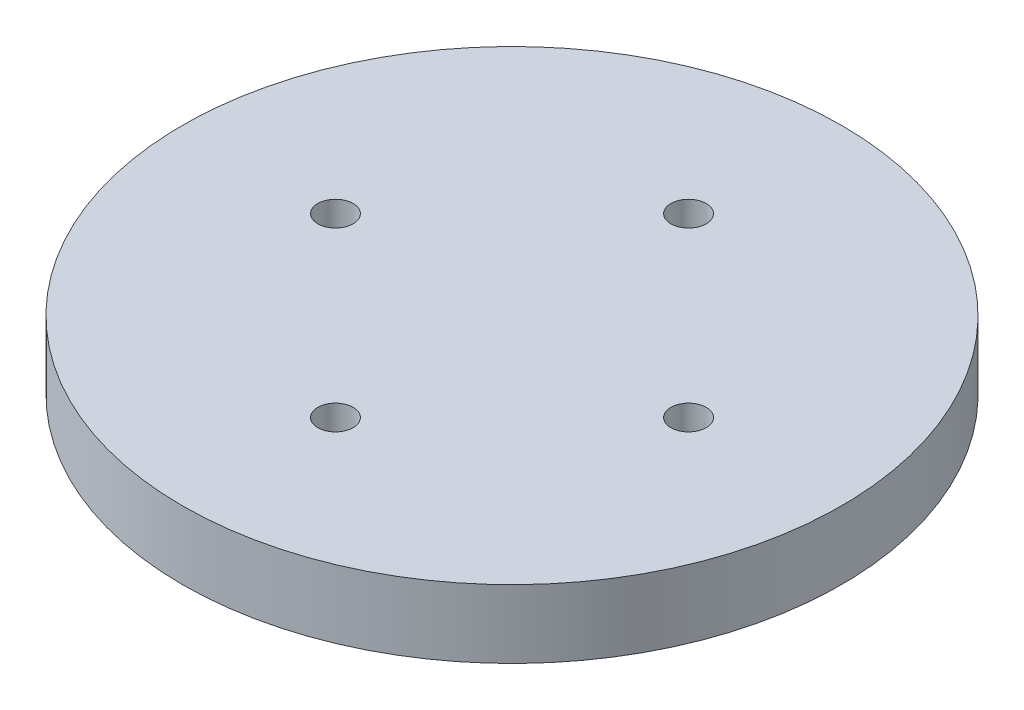
ISO-10303-21;
HEADER;
FILE_DESCRIPTION(('STEP AP214'),'2;1');
FILE_NAME('part.step','',(''),(''),'','','');
FILE_SCHEMA(('AUTOMOTIVE_DESIGN { 1 0 10303 214 1 1 1 1 }'));
ENDSEC;
DATA;
#1=APPLICATION_CONTEXT('core data for automotive mechanical design processes');
#2=APPLICATION_PROTOCOL_DEFINITION('international standard','automotive_design',2000,#1);
#3=PRODUCT_CONTEXT('',#1,'mechanical');
#4=PRODUCT('Part','Part','',(#3));
#5=PRODUCT_RELATED_PRODUCT_CATEGORY('part','',(#4));
#6=PRODUCT_DEFINITION_FORMATION('','',#4);
#7=PRODUCT_DEFINITION_CONTEXT('part definition',#1,'design');
#8=PRODUCT_DEFINITION('design','',#6,#7);
#9=PRODUCT_DEFINITION_SHAPE('','',#8);
#10=(LENGTH_UNIT() NAMED_UNIT(*) SI_UNIT(.MILLI.,.METRE.));
#11=(NAMED_UNIT(*) PLANE_ANGLE_UNIT() SI_UNIT($,.RADIAN.));
#12=(NAMED_UNIT(*) SI_UNIT($,.STERADIAN.) SOLID_ANGLE_UNIT());
#13=UNCERTAINTY_MEASURE_WITH_UNIT(LENGTH_MEASURE(1.E-05),#10,'distance_accuracy_value','');
#14=(GEOMETRIC_REPRESENTATION_CONTEXT(3) GLOBAL_UNCERTAINTY_ASSIGNED_CONTEXT((#13)) GLOBAL_UNIT_ASSIGNED_CONTEXT((#10,
#11,#12)) REPRESENTATION_CONTEXT('',''));
#15=CARTESIAN_POINT('',(0.,0.,0.));
#16=DIRECTION('',(0.,0.,1.));
#17=DIRECTION('',(1.,0.,0.));
#18=AXIS2_PLACEMENT_3D('',#15,#16,#17);
#19=CARTESIAN_POINT('',(0.,5.8,0.));
#20=DIRECTION('',(0.,1.,0.));
#21=DIRECTION('',(0.,0.,1.));
#22=AXIS2_PLACEMENT_3D('',#19,#20,#21);
#23=PLANE('',#22);
#24=CARTESIAN_POINT('',(8.48977342514678E-13,5.8,15.));
#25=DIRECTION('',(0.,1.,0.));
#26=DIRECTION('',(0.,0.,1.));
#27=AXIS2_PLACEMENT_3D('',#24,#25,#26);
#28=CIRCLE('',#27,1.50000000000091);
#29=CARTESIAN_POINT('',(8.48977342514678E-13,5.8,16.5000000000009));
#30=VERTEX_POINT('',#29);
#31=EDGE_CURVE('E54',#30,#30,#28,.T.);
#32=ORIENTED_EDGE('',*,*,#31,.F.);
#33=EDGE_LOOP('',(#32));
#34=FACE_BOUND('',#33,.T.);
#35=CARTESIAN_POINT('',(0.,5.8,-15.));
#36=DIRECTION('',(0.,1.,0.));
#37=DIRECTION('',(0.,0.,1.));
#38=AXIS2_PLACEMENT_3D('',#35,#36,#37);
#39=CIRCLE('',#38,1.5);
#40=CARTESIAN_POINT('',(0.,5.8,-13.5));
#41=VERTEX_POINT('',#40);
#42=EDGE_CURVE('E43',#41,#41,#39,.T.);
#43=ORIENTED_EDGE('',*,*,#42,.F.);
#44=EDGE_LOOP('',(#43));
#45=FACE_BOUND('',#44,.T.);
#46=CARTESIAN_POINT('',(0.,5.8,0.));
#47=DIRECTION('',(0.,1.,0.));
#48=DIRECTION('',(0.,0.,1.));
#49=AXIS2_PLACEMENT_3D('',#46,#47,#48);
#50=CIRCLE('',#49,28.);
#51=CARTESIAN_POINT('',(0.,5.8,28.));
#52=VERTEX_POINT('',#51);
#53=EDGE_CURVE('E10',#52,#52,#50,.T.);
#54=ORIENTED_EDGE('',*,*,#53,.T.);
#55=EDGE_LOOP('',(#54));
#56=FACE_BOUND('',#55,.T.);
#57=CARTESIAN_POINT('',(15.0000000000004,5.8,-4.24488671257339E-13));
#58=DIRECTION('',(0.,1.,0.));
#59=DIRECTION('',(0.,0.,1.));
#60=AXIS2_PLACEMENT_3D('',#57,#58,#59);
#61=CIRCLE('',#60,1.50000000000033);
#62=CARTESIAN_POINT('',(15.0000000000004,5.8,1.49999999999991));
#63=VERTEX_POINT('',#62);
#64=EDGE_CURVE('E48',#63,#63,#61,.T.);
#65=ORIENTED_EDGE('',*,*,#64,.F.);
#66=EDGE_LOOP('',(#65));
#67=FACE_BOUND('',#66,.T.);
#68=CARTESIAN_POINT('',(-14.9999999999996,5.8,4.2632564145606E-13));
#69=DIRECTION('',(0.,1.,0.));
#70=DIRECTION('',(0.,0.,1.));
#71=AXIS2_PLACEMENT_3D('',#68,#69,#70);
#72=CIRCLE('',#71,1.50000000000068);
#73=CARTESIAN_POINT('',(-14.9999999999996,5.8,1.50000000000111));
#74=VERTEX_POINT('',#73);
#75=EDGE_CURVE('E60',#74,#74,#72,.T.);
#76=ORIENTED_EDGE('',*,*,#75,.F.);
#77=EDGE_LOOP('',(#76));
#78=FACE_BOUND('',#77,.T.);
#79=ADVANCED_FACE('F32',(#34,#45,#56,#67,#78),#23,.T.);
#80=CARTESIAN_POINT('',(0.,0.,0.));
#81=DIRECTION('',(0.,1.,0.));
#82=DIRECTION('',(0.,0.,1.));
#83=AXIS2_PLACEMENT_3D('',#80,#81,#82);
#84=PLANE('',#83);
#85=CARTESIAN_POINT('',(0.,0.,0.));
#86=DIRECTION('',(0.,1.,0.));
#87=DIRECTION('',(0.,0.,1.));
#88=AXIS2_PLACEMENT_3D('',#85,#86,#87);
#89=CIRCLE('',#88,28.);
#90=CARTESIAN_POINT('',(0.,0.,28.));
#91=VERTEX_POINT('',#90);
#92=EDGE_CURVE('E36',#91,#91,#89,.T.);
#93=ORIENTED_EDGE('',*,*,#92,.F.);
#94=EDGE_LOOP('',(#93));
#95=FACE_BOUND('',#94,.T.);
#96=CARTESIAN_POINT('',(0.,0.,-15.));
#97=DIRECTION('',(0.,1.,0.));
#98=DIRECTION('',(0.,0.,1.));
#99=AXIS2_PLACEMENT_3D('',#96,#97,#98);
#100=CIRCLE('',#99,1.5);
#101=CARTESIAN_POINT('',(0.,0.,-13.5));
#102=VERTEX_POINT('',#101);
#103=EDGE_CURVE('E45',#102,#102,#100,.T.);
#104=ORIENTED_EDGE('',*,*,#103,.T.);
#105=EDGE_LOOP('',(#104));
#106=FACE_BOUND('',#105,.T.);
#107=CARTESIAN_POINT('',(15.0000000000004,0.,-4.24488671257339E-13));
#108=DIRECTION('',(0.,1.,0.));
#109=DIRECTION('',(0.,0.,1.));
#110=AXIS2_PLACEMENT_3D('',#107,#108,#109);
#111=CIRCLE('',#110,1.50000000000033);
#112=CARTESIAN_POINT('',(15.0000000000004,0.,1.49999999999991));
#113=VERTEX_POINT('',#112);
#114=EDGE_CURVE('E51',#113,#113,#111,.T.);
#115=ORIENTED_EDGE('',*,*,#114,.T.);
#116=EDGE_LOOP('',(#115));
#117=FACE_BOUND('',#116,.T.);
#118=CARTESIAN_POINT('',(8.48977342514678E-13,0.,15.));
#119=DIRECTION('',(0.,1.,0.));
#120=DIRECTION('',(0.,0.,1.));
#121=AXIS2_PLACEMENT_3D('',#118,#119,#120);
#122=CIRCLE('',#121,1.50000000000091);
#123=CARTESIAN_POINT('',(8.48977342514678E-13,0.,16.5000000000009));
#124=VERTEX_POINT('',#123);
#125=EDGE_CURVE('E57',#124,#124,#122,.T.);
#126=ORIENTED_EDGE('',*,*,#125,.T.);
#127=EDGE_LOOP('',(#126));
#128=FACE_BOUND('',#127,.T.);
#129=CARTESIAN_POINT('',(-14.9999999999996,0.,4.2632564145606E-13));
#130=DIRECTION('',(0.,1.,0.));
#131=DIRECTION('',(0.,0.,1.));
#132=AXIS2_PLACEMENT_3D('',#129,#130,#131);
#133=CIRCLE('',#132,1.50000000000068);
#134=CARTESIAN_POINT('',(-14.9999999999996,0.,1.50000000000111));
#135=VERTEX_POINT('',#134);
#136=EDGE_CURVE('E63',#135,#135,#133,.T.);
#137=ORIENTED_EDGE('',*,*,#136,.T.);
#138=EDGE_LOOP('',(#137));
#139=FACE_BOUND('',#138,.T.);
#140=ADVANCED_FACE('F73',(#95,#106,#117,#128,#139),#84,.F.);
#141=CARTESIAN_POINT('',(0.,5.8,0.));
#142=DIRECTION('',(0.,-1.,0.));
#143=DIRECTION('',(0.,0.,-1.));
#144=AXIS2_PLACEMENT_3D('',#141,#142,#143);
#145=CYLINDRICAL_SURFACE('',#144,28.);
#146=ORIENTED_EDGE('',*,*,#53,.F.);
#147=EDGE_LOOP('',(#146));
#148=FACE_BOUND('',#147,.T.);
#149=ORIENTED_EDGE('',*,*,#92,.T.);
#150=EDGE_LOOP('',(#149));
#151=FACE_BOUND('',#150,.T.);
#152=ADVANCED_FACE('F34',(#148,#151),#145,.T.);
#153=CARTESIAN_POINT('',(0.,5.8,-15.));
#154=DIRECTION('',(0.,-1.,0.));
#155=DIRECTION('',(0.,0.,-1.));
#156=AXIS2_PLACEMENT_3D('',#153,#154,#155);
#157=CYLINDRICAL_SURFACE('',#156,1.5);
#158=ORIENTED_EDGE('',*,*,#42,.T.);
#159=EDGE_LOOP('',(#158));
#160=FACE_BOUND('',#159,.T.);
#161=ORIENTED_EDGE('',*,*,#103,.F.);
#162=EDGE_LOOP('',(#161));
#163=FACE_BOUND('',#162,.T.);
#164=ADVANCED_FACE('F83',(#160,#163),#157,.F.);
#165=CARTESIAN_POINT('',(15.0000000000004,5.8,-4.24488671257339E-13));
#166=DIRECTION('',(0.,-1.,0.));
#167=DIRECTION('',(0.,0.,-1.));
#168=AXIS2_PLACEMENT_3D('',#165,#166,#167);
#169=CYLINDRICAL_SURFACE('',#168,1.50000000000033);
#170=ORIENTED_EDGE('',*,*,#64,.T.);
#171=EDGE_LOOP('',(#170));
#172=FACE_BOUND('',#171,.T.);
#173=ORIENTED_EDGE('',*,*,#114,.F.);
#174=EDGE_LOOP('',(#173));
#175=FACE_BOUND('',#174,.T.);
#176=ADVANCED_FACE('F86',(#172,#175),#169,.F.);
#177=CARTESIAN_POINT('',(8.48977342514678E-13,5.8,15.));
#178=DIRECTION('',(0.,-1.,0.));
#179=DIRECTION('',(0.,0.,-1.));
#180=AXIS2_PLACEMENT_3D('',#177,#178,#179);
#181=CYLINDRICAL_SURFACE('',#180,1.50000000000091);
#182=ORIENTED_EDGE('',*,*,#31,.T.);
#183=EDGE_LOOP('',(#182));
#184=FACE_BOUND('',#183,.T.);
#185=ORIENTED_EDGE('',*,*,#125,.F.);
#186=EDGE_LOOP('',(#185));
#187=FACE_BOUND('',#186,.T.);
#188=ADVANCED_FACE('F90',(#184,#187),#181,.F.);
#189=CARTESIAN_POINT('',(-14.9999999999996,5.8,4.2632564145606E-13));
#190=DIRECTION('',(0.,-1.,0.));
#191=DIRECTION('',(0.,0.,-1.));
#192=AXIS2_PLACEMENT_3D('',#189,#190,#191);
#193=CYLINDRICAL_SURFACE('',#192,1.50000000000068);
#194=ORIENTED_EDGE('',*,*,#75,.T.);
#195=EDGE_LOOP('',(#194));
#196=FACE_BOUND('',#195,.T.);
#197=ORIENTED_EDGE('',*,*,#136,.F.);
#198=EDGE_LOOP('',(#197));
#199=FACE_BOUND('',#198,.T.);
#200=ADVANCED_FACE('F69',(#196,#199),#193,.F.);
#201=CLOSED_SHELL('',(#79,#140,#152,#164,#176,#188,#200));
#202=MANIFOLD_SOLID_BREP('B2',#201);
#203=ADVANCED_BREP_SHAPE_REPRESENTATION('',(#18,#202),#14);
#204=SHAPE_DEFINITION_REPRESENTATION(#9,#203);
ENDSEC;
END-ISO-10303-21;
